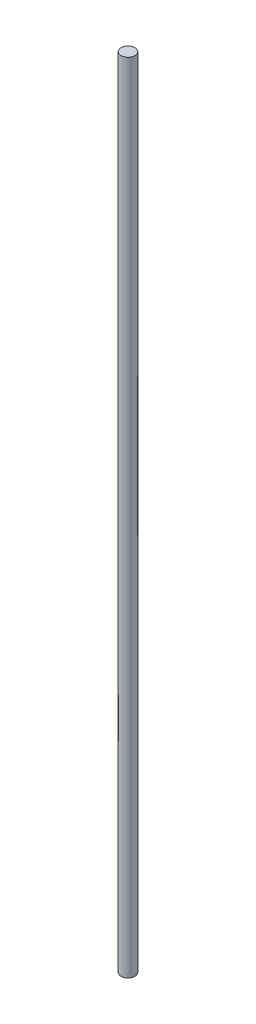
ISO-10303-21;
HEADER;
FILE_DESCRIPTION(('STEP AP214'),'2;1');
FILE_NAME('part.step','',(''),(''),'','','');
FILE_SCHEMA(('AUTOMOTIVE_DESIGN { 1 0 10303 214 1 1 1 1 }'));
ENDSEC;
DATA;
#1=APPLICATION_CONTEXT('core data for automotive mechanical design processes');
#2=APPLICATION_PROTOCOL_DEFINITION('international standard','automotive_design',2000,#1);
#3=PRODUCT_CONTEXT('',#1,'mechanical');
#4=PRODUCT('Part','Part','',(#3));
#5=PRODUCT_RELATED_PRODUCT_CATEGORY('part','',(#4));
#6=PRODUCT_DEFINITION_FORMATION('','',#4);
#7=PRODUCT_DEFINITION_CONTEXT('part definition',#1,'design');
#8=PRODUCT_DEFINITION('design','',#6,#7);
#9=PRODUCT_DEFINITION_SHAPE('','',#8);
#10=(LENGTH_UNIT() NAMED_UNIT(*) SI_UNIT(.MILLI.,.METRE.));
#11=(NAMED_UNIT(*) PLANE_ANGLE_UNIT() SI_UNIT($,.RADIAN.));
#12=(NAMED_UNIT(*) SI_UNIT($,.STERADIAN.) SOLID_ANGLE_UNIT());
#13=UNCERTAINTY_MEASURE_WITH_UNIT(LENGTH_MEASURE(1.E-05),#10,'distance_accuracy_value','');
#14=(GEOMETRIC_REPRESENTATION_CONTEXT(3) GLOBAL_UNCERTAINTY_ASSIGNED_CONTEXT((#13)) GLOBAL_UNIT_ASSIGNED_CONTEXT((#10,
#11,#12)) REPRESENTATION_CONTEXT('',''));
#15=CARTESIAN_POINT('',(0.,0.,0.));
#16=DIRECTION('',(0.,0.,1.));
#17=DIRECTION('',(1.,0.,0.));
#18=AXIS2_PLACEMENT_3D('',#15,#16,#17);
#19=CARTESIAN_POINT('',(0.,914.4,0.));
#20=DIRECTION('',(0.,-1.,0.));
#21=DIRECTION('',(0.,0.,-1.));
#22=AXIS2_PLACEMENT_3D('',#19,#20,#21);
#23=CYLINDRICAL_SURFACE('',#22,7.9375);
#24=CARTESIAN_POINT('',(0.,914.4,0.));
#25=DIRECTION('',(0.,1.,0.));
#26=DIRECTION('',(0.,0.,1.));
#27=AXIS2_PLACEMENT_3D('',#24,#25,#26);
#28=CIRCLE('',#27,7.9375);
#29=CARTESIAN_POINT('',(0.,914.4,7.9375));
#30=VERTEX_POINT('',#29);
#31=EDGE_CURVE('E10',#30,#30,#28,.T.);
#32=ORIENTED_EDGE('',*,*,#31,.F.);
#33=EDGE_LOOP('',(#32));
#34=FACE_BOUND('',#33,.T.);
#35=CARTESIAN_POINT('',(0.,0.,0.));
#36=DIRECTION('',(0.,1.,0.));
#37=DIRECTION('',(0.,0.,1.));
#38=AXIS2_PLACEMENT_3D('',#35,#36,#37);
#39=CIRCLE('',#38,7.9375);
#40=CARTESIAN_POINT('',(0.,0.,7.9375));
#41=VERTEX_POINT('',#40);
#42=EDGE_CURVE('E36',#41,#41,#39,.T.);
#43=ORIENTED_EDGE('',*,*,#42,.T.);
#44=EDGE_LOOP('',(#43));
#45=FACE_BOUND('',#44,.T.);
#46=ADVANCED_FACE('F33',(#34,#45),#23,.T.);
#47=CARTESIAN_POINT('',(0.,914.4,0.));
#48=DIRECTION('',(0.,1.,0.));
#49=DIRECTION('',(0.,0.,1.));
#50=AXIS2_PLACEMENT_3D('',#47,#48,#49);
#51=PLANE('',#50);
#52=ORIENTED_EDGE('',*,*,#31,.T.);
#53=EDGE_LOOP('',(#52));
#54=FACE_BOUND('',#53,.T.);
#55=ADVANCED_FACE('F48',(#54),#51,.T.);
#56=CARTESIAN_POINT('',(0.,0.,0.));
#57=DIRECTION('',(0.,1.,0.));
#58=DIRECTION('',(0.,0.,1.));
#59=AXIS2_PLACEMENT_3D('',#56,#57,#58);
#60=PLANE('',#59);
#61=ORIENTED_EDGE('',*,*,#42,.F.);
#62=EDGE_LOOP('',(#61));
#63=FACE_BOUND('',#62,.T.);
#64=ADVANCED_FACE('F46',(#63),#60,.F.);
#65=CLOSED_SHELL('',(#46,#55,#64));
#66=MANIFOLD_SOLID_BREP('B2',#65);
#67=ADVANCED_BREP_SHAPE_REPRESENTATION('',(#18,#66),#14);
#68=SHAPE_DEFINITION_REPRESENTATION(#9,#67);
ENDSEC;
END-ISO-10303-21;
